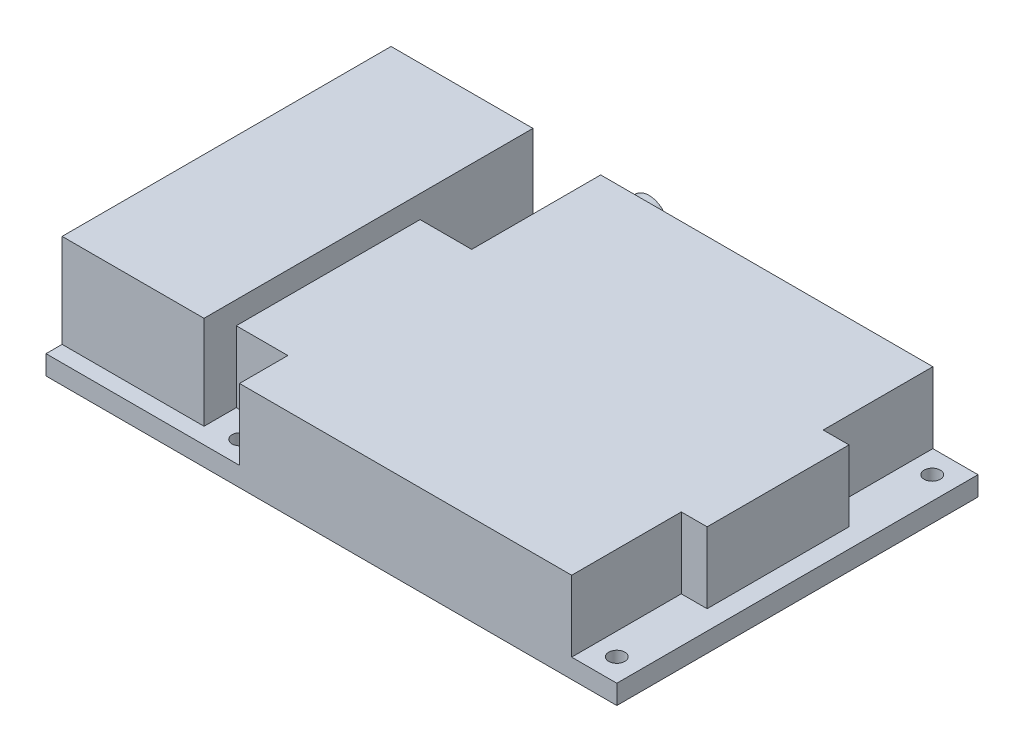
ISO-10303-21;
HEADER;
FILE_DESCRIPTION(('STEP AP214'),'2;1');
FILE_NAME('part.step','',(''),(''),'','','');
FILE_SCHEMA(('AUTOMOTIVE_DESIGN { 1 0 10303 214 1 1 1 1 }'));
ENDSEC;
DATA;
#1=APPLICATION_CONTEXT('core data for automotive mechanical design processes');
#2=APPLICATION_PROTOCOL_DEFINITION('international standard','automotive_design',2000,#1);
#3=PRODUCT_CONTEXT('',#1,'mechanical');
#4=PRODUCT('Part','Part','',(#3));
#5=PRODUCT_RELATED_PRODUCT_CATEGORY('part','',(#4));
#6=PRODUCT_DEFINITION_FORMATION('','',#4);
#7=PRODUCT_DEFINITION_CONTEXT('part definition',#1,'design');
#8=PRODUCT_DEFINITION('design','',#6,#7);
#9=PRODUCT_DEFINITION_SHAPE('','',#8);
#10=(LENGTH_UNIT() NAMED_UNIT(*) SI_UNIT(.MILLI.,.METRE.));
#11=(NAMED_UNIT(*) PLANE_ANGLE_UNIT() SI_UNIT($,.RADIAN.));
#12=(NAMED_UNIT(*) SI_UNIT($,.STERADIAN.) SOLID_ANGLE_UNIT());
#13=UNCERTAINTY_MEASURE_WITH_UNIT(LENGTH_MEASURE(1.E-05),#10,'distance_accuracy_value','');
#14=(GEOMETRIC_REPRESENTATION_CONTEXT(3) GLOBAL_UNCERTAINTY_ASSIGNED_CONTEXT((#13)) GLOBAL_UNIT_ASSIGNED_CONTEXT((#10,
#11,#12)) REPRESENTATION_CONTEXT('',''));
#15=CARTESIAN_POINT('',(0.,0.,0.));
#16=DIRECTION('',(0.,0.,1.));
#17=DIRECTION('',(1.,0.,0.));
#18=AXIS2_PLACEMENT_3D('',#15,#16,#17);
#19=CARTESIAN_POINT('',(0.,3.,0.));
#20=DIRECTION('',(0.,-1.,0.));
#21=DIRECTION('',(0.,0.,-1.));
#22=AXIS2_PLACEMENT_3D('',#19,#20,#21);
#23=PLANE('',#22);
#24=CARTESIAN_POINT('',(26.55,3.,-3.55));
#25=DIRECTION('',(0.,-1.,0.));
#26=DIRECTION('',(0.,0.,-1.));
#27=AXIS2_PLACEMENT_3D('',#24,#25,#26);
#28=CIRCLE('',#27,1.25);
#29=CARTESIAN_POINT('',(26.55,3.,-4.8));
#30=VERTEX_POINT('',#29);
#31=EDGE_CURVE('E422',#30,#30,#28,.F.);
#32=ORIENTED_EDGE('',*,*,#31,.F.);
#33=EDGE_LOOP('',(#32));
#34=FACE_BOUND('',#33,.T.);
#35=DIRECTION('',(1.,0.,0.));
#36=VECTOR('',#35,1.);
#37=CARTESIAN_POINT('',(0.,3.,-2.5));
#38=LINE('',#37,#36);
#39=CARTESIAN_POINT('',(0.,3.,-2.5));
#40=VERTEX_POINT('',#39);
#41=CARTESIAN_POINT('',(22.,3.,-2.5));
#42=VERTEX_POINT('',#41);
#43=EDGE_CURVE('E291',#40,#42,#38,.T.);
#44=ORIENTED_EDGE('',*,*,#43,.F.);
#45=DIRECTION('',(0.,0.,1.));
#46=VECTOR('',#45,1.);
#47=CARTESIAN_POINT('',(0.,3.,0.));
#48=LINE('',#47,#46);
#49=CARTESIAN_POINT('',(0.,3.,0.));
#50=VERTEX_POINT('',#49);
#51=EDGE_CURVE('E346',#40,#50,#48,.T.);
#52=ORIENTED_EDGE('',*,*,#51,.T.);
#53=DIRECTION('',(1.,0.,0.));
#54=VECTOR('',#53,1.);
#55=CARTESIAN_POINT('',(0.,3.,0.));
#56=LINE('',#55,#54);
#57=CARTESIAN_POINT('',(30.,3.,0.));
#58=VERTEX_POINT('',#57);
#59=EDGE_CURVE('E347',#50,#58,#56,.T.);
#60=ORIENTED_EDGE('',*,*,#59,.T.);
#61=DIRECTION('',(0.,0.,-1.));
#62=VECTOR('',#61,1.);
#63=CARTESIAN_POINT('',(30.,3.,0.));
#64=LINE('',#63,#62);
#65=CARTESIAN_POINT('',(30.,3.,-7.5));
#66=VERTEX_POINT('',#65);
#67=EDGE_CURVE('E250',#58,#66,#64,.T.);
#68=ORIENTED_EDGE('',*,*,#67,.T.);
#69=DIRECTION('',(-1.,0.,0.));
#70=VECTOR('',#69,1.);
#71=CARTESIAN_POINT('',(22.,3.,-7.5));
#72=LINE('',#71,#70);
#73=CARTESIAN_POINT('',(22.,3.,-7.5));
#74=VERTEX_POINT('',#73);
#75=EDGE_CURVE('E255',#66,#74,#72,.T.);
#76=ORIENTED_EDGE('',*,*,#75,.T.);
#77=DIRECTION('',(0.,0.,1.));
#78=VECTOR('',#77,1.);
#79=CARTESIAN_POINT('',(22.,3.,0.));
#80=LINE('',#79,#78);
#81=EDGE_CURVE('E205',#74,#42,#80,.T.);
#82=ORIENTED_EDGE('',*,*,#81,.T.);
#83=EDGE_LOOP('',(#44,#52,#60,#68,#76,#82));
#84=FACE_BOUND('',#83,.T.);
#85=ADVANCED_FACE('F45',(#34,#84),#23,.F.);
#86=CARTESIAN_POINT('',(26.55,3.,-52.45));
#87=DIRECTION('',(0.,-1.,0.));
#88=DIRECTION('',(0.,0.,-1.));
#89=AXIS2_PLACEMENT_3D('',#86,#87,#88);
#90=CIRCLE('',#89,1.25);
#91=CARTESIAN_POINT('',(26.55,3.,-53.7));
#92=VERTEX_POINT('',#91);
#93=EDGE_CURVE('E213',#92,#92,#90,.F.);
#94=ORIENTED_EDGE('',*,*,#93,.F.);
#95=EDGE_LOOP('',(#94));
#96=FACE_BOUND('',#95,.T.);
#97=DIRECTION('',(-1.,0.,0.));
#98=VECTOR('',#97,1.);
#99=CARTESIAN_POINT('',(0.,3.,-53.5));
#100=LINE('',#99,#98);
#101=CARTESIAN_POINT('',(22.,3.,-53.5));
#102=VERTEX_POINT('',#101);
#103=CARTESIAN_POINT('',(0.,3.,-53.5));
#104=VERTEX_POINT('',#103);
#105=EDGE_CURVE('E190',#102,#104,#100,.T.);
#106=ORIENTED_EDGE('',*,*,#105,.F.);
#107=DIRECTION('',(0.,0.,1.));
#108=VECTOR('',#107,1.);
#109=CARTESIAN_POINT('',(22.,3.,-56.));
#110=LINE('',#109,#108);
#111=CARTESIAN_POINT('',(22.,3.,-36.));
#112=VERTEX_POINT('',#111);
#113=EDGE_CURVE('E184',#102,#112,#110,.T.);
#114=ORIENTED_EDGE('',*,*,#113,.T.);
#115=DIRECTION('',(1.,0.,0.));
#116=VECTOR('',#115,1.);
#117=CARTESIAN_POINT('',(22.,3.,-36.));
#118=LINE('',#117,#116);
#119=CARTESIAN_POINT('',(30.,3.,-36.));
#120=VERTEX_POINT('',#119);
#121=EDGE_CURVE('E188',#112,#120,#118,.T.);
#122=ORIENTED_EDGE('',*,*,#121,.T.);
#123=DIRECTION('',(0.,0.,-1.));
#124=VECTOR('',#123,1.);
#125=CARTESIAN_POINT('',(30.,3.,-56.));
#126=LINE('',#125,#124);
#127=CARTESIAN_POINT('',(30.,3.,-56.));
#128=VERTEX_POINT('',#127);
#129=EDGE_CURVE('E223',#120,#128,#126,.T.);
#130=ORIENTED_EDGE('',*,*,#129,.T.);
#131=DIRECTION('',(-1.,0.,0.));
#132=VECTOR('',#131,1.);
#133=CARTESIAN_POINT('',(0.,3.,-56.));
#134=LINE('',#133,#132);
#135=CARTESIAN_POINT('',(0.,3.,-56.));
#136=VERTEX_POINT('',#135);
#137=EDGE_CURVE('E353',#128,#136,#134,.T.);
#138=ORIENTED_EDGE('',*,*,#137,.T.);
#139=EDGE_CURVE('E342',#136,#104,#48,.T.);
#140=ORIENTED_EDGE('',*,*,#139,.T.);
#141=EDGE_LOOP('',(#106,#114,#122,#130,#138,#140));
#142=FACE_BOUND('',#141,.T.);
#143=ADVANCED_FACE('F186',(#96,#142),#23,.F.);
#144=CARTESIAN_POINT('',(84.95,3.,-3.55));
#145=DIRECTION('',(0.,-1.,0.));
#146=DIRECTION('',(0.,0.,-1.));
#147=AXIS2_PLACEMENT_3D('',#144,#145,#146);
#148=CIRCLE('',#147,1.25);
#149=CARTESIAN_POINT('',(84.95,3.,-4.8));
#150=VERTEX_POINT('',#149);
#151=EDGE_CURVE('E418',#150,#150,#148,.F.);
#152=ORIENTED_EDGE('',*,*,#151,.F.);
#153=EDGE_LOOP('',(#152));
#154=FACE_BOUND('',#153,.T.);
#155=CARTESIAN_POINT('',(84.95,3.,-52.45));
#156=DIRECTION('',(0.,-1.,0.));
#157=DIRECTION('',(0.,0.,-1.));
#158=AXIS2_PLACEMENT_3D('',#155,#156,#157);
#159=CIRCLE('',#158,1.25);
#160=CARTESIAN_POINT('',(84.95,3.,-53.7));
#161=VERTEX_POINT('',#160);
#162=EDGE_CURVE('E412',#161,#161,#159,.F.);
#163=ORIENTED_EDGE('',*,*,#162,.F.);
#164=EDGE_LOOP('',(#163));
#165=FACE_BOUND('',#164,.T.);
#166=DIRECTION('',(0.,0.,-1.));
#167=VECTOR('',#166,1.);
#168=CARTESIAN_POINT('',(85.5,3.,-56.));
#169=LINE('',#168,#167);
#170=CARTESIAN_POINT('',(85.5,3.,-17.));
#171=VERTEX_POINT('',#170);
#172=CARTESIAN_POINT('',(85.5,3.,-39.));
#173=VERTEX_POINT('',#172);
#174=EDGE_CURVE('E323',#171,#173,#169,.T.);
#175=ORIENTED_EDGE('',*,*,#174,.F.);
#176=DIRECTION('',(-1.,0.,0.));
#177=VECTOR('',#176,1.);
#178=CARTESIAN_POINT('',(85.5,3.,-17.));
#179=LINE('',#178,#177);
#180=CARTESIAN_POINT('',(81.5,3.,-17.));
#181=VERTEX_POINT('',#180);
#182=EDGE_CURVE('E232',#171,#181,#179,.T.);
#183=ORIENTED_EDGE('',*,*,#182,.T.);
#184=DIRECTION('',(0.,0.,1.));
#185=VECTOR('',#184,1.);
#186=CARTESIAN_POINT('',(81.5,3.,0.));
#187=LINE('',#186,#185);
#188=CARTESIAN_POINT('',(81.5,3.,0.));
#189=VERTEX_POINT('',#188);
#190=EDGE_CURVE('E271',#181,#189,#187,.T.);
#191=ORIENTED_EDGE('',*,*,#190,.T.);
#192=CARTESIAN_POINT('',(88.5,3.,0.));
#193=VERTEX_POINT('',#192);
#194=EDGE_CURVE('E345',#189,#193,#56,.T.);
#195=ORIENTED_EDGE('',*,*,#194,.T.);
#196=DIRECTION('',(0.,0.,-1.));
#197=VECTOR('',#196,1.);
#198=CARTESIAN_POINT('',(88.5,3.,0.));
#199=LINE('',#198,#197);
#200=CARTESIAN_POINT('',(88.5,3.,-56.));
#201=VERTEX_POINT('',#200);
#202=EDGE_CURVE('E350',#193,#201,#199,.T.);
#203=ORIENTED_EDGE('',*,*,#202,.T.);
#204=CARTESIAN_POINT('',(81.5,3.,-56.));
#205=VERTEX_POINT('',#204);
#206=EDGE_CURVE('E354',#201,#205,#134,.T.);
#207=ORIENTED_EDGE('',*,*,#206,.T.);
#208=DIRECTION('',(0.,0.,1.));
#209=VECTOR('',#208,1.);
#210=CARTESIAN_POINT('',(81.5,3.,-56.));
#211=LINE('',#210,#209);
#212=CARTESIAN_POINT('',(81.5,3.,-39.));
#213=VERTEX_POINT('',#212);
#214=EDGE_CURVE('E233',#205,#213,#211,.T.);
#215=ORIENTED_EDGE('',*,*,#214,.T.);
#216=DIRECTION('',(1.,0.,0.));
#217=VECTOR('',#216,1.);
#218=CARTESIAN_POINT('',(85.5,3.,-39.));
#219=LINE('',#218,#217);
#220=EDGE_CURVE('E236',#213,#173,#219,.T.);
#221=ORIENTED_EDGE('',*,*,#220,.T.);
#222=EDGE_LOOP('',(#175,#183,#191,#195,#203,#207,#215,#221));
#223=FACE_BOUND('',#222,.T.);
#224=ADVANCED_FACE('F472',(#154,#165,#223),#23,.F.);
#225=CARTESIAN_POINT('',(0.,3.,0.));
#226=DIRECTION('',(1.,0.,0.));
#227=DIRECTION('',(0.,0.,-1.));
#228=AXIS2_PLACEMENT_3D('',#225,#226,#227);
#229=PLANE('',#228);
#230=DIRECTION('',(0.,0.,1.));
#231=VECTOR('',#230,1.);
#232=CARTESIAN_POINT('',(0.,0.,0.));
#233=LINE('',#232,#231);
#234=CARTESIAN_POINT('',(0.,0.,-56.));
#235=VERTEX_POINT('',#234);
#236=CARTESIAN_POINT('',(0.,0.,0.));
#237=VERTEX_POINT('',#236);
#238=EDGE_CURVE('E338',#235,#237,#233,.T.);
#239=ORIENTED_EDGE('',*,*,#238,.T.);
#240=DIRECTION('',(0.,-1.,0.));
#241=VECTOR('',#240,1.);
#242=CARTESIAN_POINT('',(0.,3.,0.));
#243=LINE('',#242,#241);
#244=EDGE_CURVE('E381',#50,#237,#243,.T.);
#245=ORIENTED_EDGE('',*,*,#244,.F.);
#246=ORIENTED_EDGE('',*,*,#51,.F.);
#247=DIRECTION('',(0.,-1.,0.));
#248=VECTOR('',#247,1.);
#249=CARTESIAN_POINT('',(0.,17.5,-2.5));
#250=LINE('',#249,#248);
#251=CARTESIAN_POINT('',(0.,17.5,-2.5));
#252=VERTEX_POINT('',#251);
#253=EDGE_CURVE('E320',#252,#40,#250,.T.);
#254=ORIENTED_EDGE('',*,*,#253,.F.);
#255=DIRECTION('',(0.,0.,1.));
#256=VECTOR('',#255,1.);
#257=CARTESIAN_POINT('',(0.,17.5,-2.5));
#258=LINE('',#257,#256);
#259=CARTESIAN_POINT('',(0.,17.5,-53.5));
#260=VERTEX_POINT('',#259);
#261=EDGE_CURVE('E292',#260,#252,#258,.T.);
#262=ORIENTED_EDGE('',*,*,#261,.F.);
#263=DIRECTION('',(0.,-1.,0.));
#264=VECTOR('',#263,1.);
#265=CARTESIAN_POINT('',(0.,17.5,-53.5));
#266=LINE('',#265,#264);
#267=EDGE_CURVE('E305',#260,#104,#266,.T.);
#268=ORIENTED_EDGE('',*,*,#267,.T.);
#269=ORIENTED_EDGE('',*,*,#139,.F.);
#270=DIRECTION('',(0.,-1.,0.));
#271=VECTOR('',#270,1.);
#272=CARTESIAN_POINT('',(0.,3.,-56.));
#273=LINE('',#272,#271);
#274=EDGE_CURVE('E357',#136,#235,#273,.T.);
#275=ORIENTED_EDGE('',*,*,#274,.T.);
#276=EDGE_LOOP('',(#239,#245,#246,#254,#262,#268,#269,#275));
#277=FACE_BOUND('',#276,.T.);
#278=ADVANCED_FACE('F47',(#277),#229,.F.);
#279=CARTESIAN_POINT('',(0.,3.,0.));
#280=DIRECTION('',(0.,0.,-1.));
#281=DIRECTION('',(-1.,0.,0.));
#282=AXIS2_PLACEMENT_3D('',#279,#280,#281);
#283=PLANE('',#282);
#284=DIRECTION('',(0.,1.,0.));
#285=VECTOR('',#284,1.);
#286=CARTESIAN_POINT('',(30.,-18.540659228538,0.));
#287=LINE('',#286,#285);
#288=CARTESIAN_POINT('',(30.,14.,0.));
#289=VERTEX_POINT('',#288);
#290=EDGE_CURVE('E241',#58,#289,#287,.T.);
#291=ORIENTED_EDGE('',*,*,#290,.F.);
#292=ORIENTED_EDGE('',*,*,#59,.F.);
#293=ORIENTED_EDGE('',*,*,#244,.T.);
#294=DIRECTION('',(1.,0.,0.));
#295=VECTOR('',#294,1.);
#296=CARTESIAN_POINT('',(0.,0.,0.));
#297=LINE('',#296,#295);
#298=CARTESIAN_POINT('',(88.5,0.,0.));
#299=VERTEX_POINT('',#298);
#300=EDGE_CURVE('E361',#237,#299,#297,.T.);
#301=ORIENTED_EDGE('',*,*,#300,.T.);
#302=DIRECTION('',(0.,-1.,0.));
#303=VECTOR('',#302,1.);
#304=CARTESIAN_POINT('',(88.5,3.,0.));
#305=LINE('',#304,#303);
#306=EDGE_CURVE('E377',#193,#299,#305,.T.);
#307=ORIENTED_EDGE('',*,*,#306,.F.);
#308=ORIENTED_EDGE('',*,*,#194,.F.);
#309=DIRECTION('',(0.,1.,0.));
#310=VECTOR('',#309,1.);
#311=CARTESIAN_POINT('',(81.5,-18.540659228538,0.));
#312=LINE('',#311,#310);
#313=CARTESIAN_POINT('',(81.5,14.,0.));
#314=VERTEX_POINT('',#313);
#315=EDGE_CURVE('E275',#189,#314,#312,.T.);
#316=ORIENTED_EDGE('',*,*,#315,.T.);
#317=DIRECTION('',(1.,0.,0.));
#318=VECTOR('',#317,1.);
#319=CARTESIAN_POINT('',(85.5,14.,0.));
#320=LINE('',#319,#318);
#321=EDGE_CURVE('E334',#289,#314,#320,.T.);
#322=ORIENTED_EDGE('',*,*,#321,.F.);
#323=EDGE_LOOP('',(#291,#292,#293,#301,#307,#308,#316,#322));
#324=FACE_BOUND('',#323,.T.);
#325=ADVANCED_FACE('F509',(#324),#283,.F.);
#326=CARTESIAN_POINT('',(88.5,3.,0.));
#327=DIRECTION('',(-1.,0.,0.));
#328=DIRECTION('',(0.,0.,1.));
#329=AXIS2_PLACEMENT_3D('',#326,#327,#328);
#330=PLANE('',#329);
#331=DIRECTION('',(0.,0.,-1.));
#332=VECTOR('',#331,1.);
#333=CARTESIAN_POINT('',(88.5,0.,0.));
#334=LINE('',#333,#332);
#335=CARTESIAN_POINT('',(88.5,0.,-56.));
#336=VERTEX_POINT('',#335);
#337=EDGE_CURVE('E364',#299,#336,#334,.T.);
#338=ORIENTED_EDGE('',*,*,#337,.T.);
#339=DIRECTION('',(0.,-1.,0.));
#340=VECTOR('',#339,1.);
#341=CARTESIAN_POINT('',(88.5,3.,-56.));
#342=LINE('',#341,#340);
#343=EDGE_CURVE('E373',#201,#336,#342,.T.);
#344=ORIENTED_EDGE('',*,*,#343,.F.);
#345=ORIENTED_EDGE('',*,*,#202,.F.);
#346=ORIENTED_EDGE('',*,*,#306,.T.);
#347=EDGE_LOOP('',(#338,#344,#345,#346));
#348=FACE_BOUND('',#347,.T.);
#349=ADVANCED_FACE('F455',(#348),#330,.F.);
#350=CARTESIAN_POINT('',(0.,3.,-56.));
#351=DIRECTION('',(0.,0.,1.));
#352=DIRECTION('',(1.,0.,0.));
#353=AXIS2_PLACEMENT_3D('',#350,#351,#352);
#354=PLANE('',#353);
#355=CARTESIAN_POINT('',(35.,9.5,-56.));
#356=DIRECTION('',(0.,0.,1.));
#357=DIRECTION('',(1.,0.,0.));
#358=AXIS2_PLACEMENT_3D('',#355,#356,#357);
#359=CIRCLE('',#358,3.);
#360=CARTESIAN_POINT('',(38.,9.5,-56.));
#361=VERTEX_POINT('',#360);
#362=EDGE_CURVE('E11',#361,#361,#359,.F.);
#363=ORIENTED_EDGE('',*,*,#362,.F.);
#364=EDGE_LOOP('',(#363));
#365=FACE_BOUND('',#364,.T.);
#366=DIRECTION('',(0.,1.,0.));
#367=VECTOR('',#366,1.);
#368=CARTESIAN_POINT('',(81.5,-18.540659228538,-56.));
#369=LINE('',#368,#367);
#370=CARTESIAN_POINT('',(81.5,14.,-56.));
#371=VERTEX_POINT('',#370);
#372=EDGE_CURVE('E229',#205,#371,#369,.T.);
#373=ORIENTED_EDGE('',*,*,#372,.F.);
#374=ORIENTED_EDGE('',*,*,#206,.F.);
#375=ORIENTED_EDGE('',*,*,#343,.T.);
#376=DIRECTION('',(-1.,0.,0.));
#377=VECTOR('',#376,1.);
#378=CARTESIAN_POINT('',(0.,0.,-56.));
#379=LINE('',#378,#377);
#380=EDGE_CURVE('E367',#336,#235,#379,.T.);
#381=ORIENTED_EDGE('',*,*,#380,.T.);
#382=ORIENTED_EDGE('',*,*,#274,.F.);
#383=ORIENTED_EDGE('',*,*,#137,.F.);
#384=DIRECTION('',(0.,1.,0.));
#385=VECTOR('',#384,1.);
#386=CARTESIAN_POINT('',(30.,-18.540659228538,-56.));
#387=LINE('',#386,#385);
#388=CARTESIAN_POINT('',(30.,14.,-56.));
#389=VERTEX_POINT('',#388);
#390=EDGE_CURVE('E195',#128,#389,#387,.T.);
#391=ORIENTED_EDGE('',*,*,#390,.T.);
#392=DIRECTION('',(-1.,0.,0.));
#393=VECTOR('',#392,1.);
#394=CARTESIAN_POINT('',(85.5,14.,-56.));
#395=LINE('',#394,#393);
#396=EDGE_CURVE('E328',#371,#389,#395,.T.);
#397=ORIENTED_EDGE('',*,*,#396,.F.);
#398=EDGE_LOOP('',(#373,#374,#375,#381,#382,#383,#391,#397));
#399=FACE_BOUND('',#398,.T.);
#400=ADVANCED_FACE('F451',(#365,#399),#354,.F.);
#401=CARTESIAN_POINT('',(0.,0.,0.));
#402=DIRECTION('',(0.,-1.,0.));
#403=DIRECTION('',(0.,0.,-1.));
#404=AXIS2_PLACEMENT_3D('',#401,#402,#403);
#405=PLANE('',#404);
#406=CARTESIAN_POINT('',(26.55,0.,-52.45));
#407=DIRECTION('',(0.,-1.,0.));
#408=DIRECTION('',(0.,0.,-1.));
#409=AXIS2_PLACEMENT_3D('',#406,#407,#408);
#410=CIRCLE('',#409,1.25);
#411=CARTESIAN_POINT('',(26.55,0.,-53.7));
#412=VERTEX_POINT('',#411);
#413=EDGE_CURVE('E217',#412,#412,#410,.F.);
#414=ORIENTED_EDGE('',*,*,#413,.T.);
#415=EDGE_LOOP('',(#414));
#416=FACE_BOUND('',#415,.T.);
#417=CARTESIAN_POINT('',(26.55,0.,-3.55));
#418=DIRECTION('',(0.,-1.,0.));
#419=DIRECTION('',(0.,0.,-1.));
#420=AXIS2_PLACEMENT_3D('',#417,#418,#419);
#421=CIRCLE('',#420,1.25);
#422=CARTESIAN_POINT('',(26.55,0.,-4.8));
#423=VERTEX_POINT('',#422);
#424=EDGE_CURVE('E419',#423,#423,#421,.F.);
#425=ORIENTED_EDGE('',*,*,#424,.T.);
#426=EDGE_LOOP('',(#425));
#427=FACE_BOUND('',#426,.T.);
#428=CARTESIAN_POINT('',(84.95,0.,-3.55));
#429=DIRECTION('',(0.,-1.,0.));
#430=DIRECTION('',(0.,0.,-1.));
#431=AXIS2_PLACEMENT_3D('',#428,#429,#430);
#432=CIRCLE('',#431,1.25);
#433=CARTESIAN_POINT('',(84.95,0.,-4.8));
#434=VERTEX_POINT('',#433);
#435=EDGE_CURVE('E414',#434,#434,#432,.F.);
#436=ORIENTED_EDGE('',*,*,#435,.T.);
#437=EDGE_LOOP('',(#436));
#438=FACE_BOUND('',#437,.T.);
#439=CARTESIAN_POINT('',(84.95,0.,-52.45));
#440=DIRECTION('',(0.,-1.,0.));
#441=DIRECTION('',(0.,0.,-1.));
#442=AXIS2_PLACEMENT_3D('',#439,#440,#441);
#443=CIRCLE('',#442,1.25);
#444=CARTESIAN_POINT('',(84.95,0.,-53.7));
#445=VERTEX_POINT('',#444);
#446=EDGE_CURVE('E408',#445,#445,#443,.F.);
#447=ORIENTED_EDGE('',*,*,#446,.T.);
#448=EDGE_LOOP('',(#447));
#449=FACE_BOUND('',#448,.T.);
#450=ORIENTED_EDGE('',*,*,#238,.F.);
#451=ORIENTED_EDGE('',*,*,#380,.F.);
#452=ORIENTED_EDGE('',*,*,#337,.F.);
#453=ORIENTED_EDGE('',*,*,#300,.F.);
#454=EDGE_LOOP('',(#450,#451,#452,#453));
#455=FACE_BOUND('',#454,.T.);
#456=ADVANCED_FACE('F454',(#416,#427,#438,#449,#455),#405,.T.);
#457=CARTESIAN_POINT('',(85.5,14.,-56.));
#458=DIRECTION('',(-1.,0.,0.));
#459=DIRECTION('',(0.,0.,1.));
#460=AXIS2_PLACEMENT_3D('',#457,#458,#459);
#461=PLANE('',#460);
#462=ORIENTED_EDGE('',*,*,#174,.T.);
#463=DIRECTION('',(0.,1.,0.));
#464=VECTOR('',#463,1.);
#465=CARTESIAN_POINT('',(85.5,-18.540659228538,-39.));
#466=LINE('',#465,#464);
#467=CARTESIAN_POINT('',(85.5,14.,-39.));
#468=VERTEX_POINT('',#467);
#469=EDGE_CURVE('E237',#173,#468,#466,.T.);
#470=ORIENTED_EDGE('',*,*,#469,.T.);
#471=DIRECTION('',(0.,0.,-1.));
#472=VECTOR('',#471,1.);
#473=CARTESIAN_POINT('',(85.5,14.,-56.));
#474=LINE('',#473,#472);
#475=CARTESIAN_POINT('',(85.5,14.,-17.));
#476=VERTEX_POINT('',#475);
#477=EDGE_CURVE('E324',#476,#468,#474,.T.);
#478=ORIENTED_EDGE('',*,*,#477,.F.);
#479=DIRECTION('',(0.,1.,0.));
#480=VECTOR('',#479,1.);
#481=CARTESIAN_POINT('',(85.5,-18.540659228538,-17.));
#482=LINE('',#481,#480);
#483=EDGE_CURVE('E279',#171,#476,#482,.T.);
#484=ORIENTED_EDGE('',*,*,#483,.F.);
#485=EDGE_LOOP('',(#462,#470,#478,#484));
#486=FACE_BOUND('',#485,.T.);
#487=ADVANCED_FACE('F468',(#486),#461,.F.);
#488=CARTESIAN_POINT('',(0.,14.,0.));
#489=DIRECTION('',(0.,-1.,0.));
#490=DIRECTION('',(0.,0.,-1.));
#491=AXIS2_PLACEMENT_3D('',#488,#489,#490);
#492=PLANE('',#491);
#493=DIRECTION('',(-1.,0.,0.));
#494=VECTOR('',#493,1.);
#495=CARTESIAN_POINT('',(0.,14.,-39.));
#496=LINE('',#495,#494);
#497=CARTESIAN_POINT('',(81.5,14.,-39.));
#498=VERTEX_POINT('',#497);
#499=EDGE_CURVE('E401',#468,#498,#496,.T.);
#500=ORIENTED_EDGE('',*,*,#499,.T.);
#501=DIRECTION('',(0.,0.,-1.));
#502=VECTOR('',#501,1.);
#503=CARTESIAN_POINT('',(81.5,14.,0.));
#504=LINE('',#503,#502);
#505=EDGE_CURVE('E54',#498,#371,#504,.T.);
#506=ORIENTED_EDGE('',*,*,#505,.T.);
#507=ORIENTED_EDGE('',*,*,#396,.T.);
#508=DIRECTION('',(0.,0.,1.));
#509=VECTOR('',#508,1.);
#510=CARTESIAN_POINT('',(30.,14.,0.));
#511=LINE('',#510,#509);
#512=CARTESIAN_POINT('',(30.,14.,-36.));
#513=VERTEX_POINT('',#512);
#514=EDGE_CURVE('E393',#389,#513,#511,.T.);
#515=ORIENTED_EDGE('',*,*,#514,.T.);
#516=DIRECTION('',(-1.,0.,0.));
#517=VECTOR('',#516,1.);
#518=CARTESIAN_POINT('',(0.,14.,-36.));
#519=LINE('',#518,#517);
#520=CARTESIAN_POINT('',(22.,14.,-36.));
#521=VERTEX_POINT('',#520);
#522=EDGE_CURVE('E284',#513,#521,#519,.T.);
#523=ORIENTED_EDGE('',*,*,#522,.T.);
#524=DIRECTION('',(0.,0.,1.));
#525=VECTOR('',#524,1.);
#526=CARTESIAN_POINT('',(22.,14.,-56.));
#527=LINE('',#526,#525);
#528=CARTESIAN_POINT('',(22.,14.,-7.5));
#529=VERTEX_POINT('',#528);
#530=EDGE_CURVE('E211',#521,#529,#527,.T.);
#531=ORIENTED_EDGE('',*,*,#530,.T.);
#532=DIRECTION('',(1.,0.,0.));
#533=VECTOR('',#532,1.);
#534=CARTESIAN_POINT('',(0.,14.,-7.5));
#535=LINE('',#534,#533);
#536=CARTESIAN_POINT('',(30.,14.,-7.5));
#537=VERTEX_POINT('',#536);
#538=EDGE_CURVE('E287',#529,#537,#535,.T.);
#539=ORIENTED_EDGE('',*,*,#538,.T.);
#540=DIRECTION('',(0.,0.,1.));
#541=VECTOR('',#540,1.);
#542=CARTESIAN_POINT('',(30.,14.,0.));
#543=LINE('',#542,#541);
#544=EDGE_CURVE('E397',#537,#289,#543,.T.);
#545=ORIENTED_EDGE('',*,*,#544,.T.);
#546=ORIENTED_EDGE('',*,*,#321,.T.);
#547=DIRECTION('',(0.,0.,-1.));
#548=VECTOR('',#547,1.);
#549=CARTESIAN_POINT('',(81.5,14.,0.));
#550=LINE('',#549,#548);
#551=CARTESIAN_POINT('',(81.5,14.,-17.));
#552=VERTEX_POINT('',#551);
#553=EDGE_CURVE('E385',#314,#552,#550,.T.);
#554=ORIENTED_EDGE('',*,*,#553,.T.);
#555=DIRECTION('',(1.,0.,0.));
#556=VECTOR('',#555,1.);
#557=CARTESIAN_POINT('',(0.,14.,-17.));
#558=LINE('',#557,#556);
#559=EDGE_CURVE('E389',#552,#476,#558,.T.);
#560=ORIENTED_EDGE('',*,*,#559,.T.);
#561=ORIENTED_EDGE('',*,*,#477,.T.);
#562=EDGE_LOOP('',(#500,#506,#507,#515,#523,#531,#539,#545,#546,#554,#560,#561));
#563=FACE_BOUND('',#562,.T.);
#564=ADVANCED_FACE('F464',(#563),#492,.F.);
#565=CARTESIAN_POINT('',(22.,17.5,-2.5));
#566=DIRECTION('',(-1.,0.,0.));
#567=DIRECTION('',(0.,0.,1.));
#568=AXIS2_PLACEMENT_3D('',#565,#566,#567);
#569=PLANE('',#568);
#570=DIRECTION('',(0.,-1.,0.));
#571=VECTOR('',#570,1.);
#572=CARTESIAN_POINT('',(22.,17.5,-53.5));
#573=LINE('',#572,#571);
#574=CARTESIAN_POINT('',(22.,17.5,-53.5));
#575=VERTEX_POINT('',#574);
#576=EDGE_CURVE('E314',#575,#102,#573,.T.);
#577=ORIENTED_EDGE('',*,*,#576,.F.);
#578=DIRECTION('',(0.,0.,-1.));
#579=VECTOR('',#578,1.);
#580=CARTESIAN_POINT('',(22.,17.5,-2.5));
#581=LINE('',#580,#579);
#582=CARTESIAN_POINT('',(22.,17.5,-2.5));
#583=VERTEX_POINT('',#582);
#584=EDGE_CURVE('E299',#583,#575,#581,.T.);
#585=ORIENTED_EDGE('',*,*,#584,.F.);
#586=DIRECTION('',(0.,-1.,0.));
#587=VECTOR('',#586,1.);
#588=CARTESIAN_POINT('',(22.,17.5,-2.5));
#589=LINE('',#588,#587);
#590=EDGE_CURVE('E317',#583,#42,#589,.T.);
#591=ORIENTED_EDGE('',*,*,#590,.T.);
#592=ORIENTED_EDGE('',*,*,#81,.F.);
#593=DIRECTION('',(0.,1.,0.));
#594=VECTOR('',#593,1.);
#595=CARTESIAN_POINT('',(22.,-18.540659228538,-7.5));
#596=LINE('',#595,#594);
#597=EDGE_CURVE('E256',#74,#529,#596,.T.);
#598=ORIENTED_EDGE('',*,*,#597,.T.);
#599=ORIENTED_EDGE('',*,*,#530,.F.);
#600=DIRECTION('',(0.,1.,0.));
#601=VECTOR('',#600,1.);
#602=CARTESIAN_POINT('',(22.,-18.540659228538,-36.));
#603=LINE('',#602,#601);
#604=EDGE_CURVE('E196',#112,#521,#603,.T.);
#605=ORIENTED_EDGE('',*,*,#604,.F.);
#606=ORIENTED_EDGE('',*,*,#113,.F.);
#607=EDGE_LOOP('',(#577,#585,#591,#592,#598,#599,#605,#606));
#608=FACE_BOUND('',#607,.T.);
#609=ADVANCED_FACE('F208',(#608),#569,.F.);
#610=CARTESIAN_POINT('',(0.,17.5,-2.5));
#611=DIRECTION('',(0.,0.,-1.));
#612=DIRECTION('',(-1.,0.,0.));
#613=AXIS2_PLACEMENT_3D('',#610,#611,#612);
#614=PLANE('',#613);
#615=ORIENTED_EDGE('',*,*,#43,.T.);
#616=ORIENTED_EDGE('',*,*,#590,.F.);
#617=DIRECTION('',(1.,0.,0.));
#618=VECTOR('',#617,1.);
#619=CARTESIAN_POINT('',(0.,17.5,-2.5));
#620=LINE('',#619,#618);
#621=EDGE_CURVE('E296',#252,#583,#620,.T.);
#622=ORIENTED_EDGE('',*,*,#621,.F.);
#623=ORIENTED_EDGE('',*,*,#253,.T.);
#624=EDGE_LOOP('',(#615,#616,#622,#623));
#625=FACE_BOUND('',#624,.T.);
#626=ADVANCED_FACE('F500',(#625),#614,.F.);
#627=CARTESIAN_POINT('',(0.,17.5,-53.5));
#628=DIRECTION('',(0.,0.,1.));
#629=DIRECTION('',(1.,0.,0.));
#630=AXIS2_PLACEMENT_3D('',#627,#628,#629);
#631=PLANE('',#630);
#632=ORIENTED_EDGE('',*,*,#105,.T.);
#633=ORIENTED_EDGE('',*,*,#267,.F.);
#634=DIRECTION('',(-1.,0.,0.));
#635=VECTOR('',#634,1.);
#636=CARTESIAN_POINT('',(0.,17.5,-53.5));
#637=LINE('',#636,#635);
#638=EDGE_CURVE('E302',#575,#260,#637,.T.);
#639=ORIENTED_EDGE('',*,*,#638,.F.);
#640=ORIENTED_EDGE('',*,*,#576,.T.);
#641=EDGE_LOOP('',(#632,#633,#639,#640));
#642=FACE_BOUND('',#641,.T.);
#643=ADVANCED_FACE('F575',(#642),#631,.F.);
#644=CARTESIAN_POINT('',(0.,17.5,0.));
#645=DIRECTION('',(0.,-1.,0.));
#646=DIRECTION('',(0.,0.,-1.));
#647=AXIS2_PLACEMENT_3D('',#644,#645,#646);
#648=PLANE('',#647);
#649=ORIENTED_EDGE('',*,*,#261,.T.);
#650=ORIENTED_EDGE('',*,*,#621,.T.);
#651=ORIENTED_EDGE('',*,*,#584,.T.);
#652=ORIENTED_EDGE('',*,*,#638,.T.);
#653=EDGE_LOOP('',(#649,#650,#651,#652));
#654=FACE_BOUND('',#653,.T.);
#655=ADVANCED_FACE('F559',(#654),#648,.F.);
#656=CARTESIAN_POINT('',(30.,-18.540659228538,-56.));
#657=DIRECTION('',(1.,0.,0.));
#658=DIRECTION('',(0.,0.,-1.));
#659=AXIS2_PLACEMENT_3D('',#656,#657,#658);
#660=PLANE('',#659);
#661=ORIENTED_EDGE('',*,*,#390,.F.);
#662=ORIENTED_EDGE('',*,*,#129,.F.);
#663=DIRECTION('',(0.,1.,0.));
#664=VECTOR('',#663,1.);
#665=CARTESIAN_POINT('',(30.,-18.540659228538,-36.));
#666=LINE('',#665,#664);
#667=EDGE_CURVE('E203',#120,#513,#666,.T.);
#668=ORIENTED_EDGE('',*,*,#667,.T.);
#669=ORIENTED_EDGE('',*,*,#514,.F.);
#670=EDGE_LOOP('',(#661,#662,#668,#669));
#671=FACE_BOUND('',#670,.T.);
#672=ADVANCED_FACE('F489',(#671),#660,.F.);
#673=CARTESIAN_POINT('',(22.,-18.540659228538,-36.));
#674=DIRECTION('',(0.,0.,1.));
#675=DIRECTION('',(1.,0.,0.));
#676=AXIS2_PLACEMENT_3D('',#673,#674,#675);
#677=PLANE('',#676);
#678=ORIENTED_EDGE('',*,*,#667,.F.);
#679=ORIENTED_EDGE('',*,*,#121,.F.);
#680=ORIENTED_EDGE('',*,*,#604,.T.);
#681=ORIENTED_EDGE('',*,*,#522,.F.);
#682=EDGE_LOOP('',(#678,#679,#680,#681));
#683=FACE_BOUND('',#682,.T.);
#684=ADVANCED_FACE('F200',(#683),#677,.F.);
#685=CARTESIAN_POINT('',(30.,-18.540659228538,0.));
#686=DIRECTION('',(1.,0.,0.));
#687=DIRECTION('',(0.,0.,-1.));
#688=AXIS2_PLACEMENT_3D('',#685,#686,#687);
#689=PLANE('',#688);
#690=DIRECTION('',(0.,1.,0.));
#691=VECTOR('',#690,1.);
#692=CARTESIAN_POINT('',(30.,-18.540659228538,-7.5));
#693=LINE('',#692,#691);
#694=EDGE_CURVE('E251',#66,#537,#693,.T.);
#695=ORIENTED_EDGE('',*,*,#694,.F.);
#696=ORIENTED_EDGE('',*,*,#67,.F.);
#697=ORIENTED_EDGE('',*,*,#290,.T.);
#698=ORIENTED_EDGE('',*,*,#544,.F.);
#699=EDGE_LOOP('',(#695,#696,#697,#698));
#700=FACE_BOUND('',#699,.T.);
#701=ADVANCED_FACE('F511',(#700),#689,.F.);
#702=CARTESIAN_POINT('',(22.,-18.540659228538,-7.5));
#703=DIRECTION('',(0.,0.,-1.));
#704=DIRECTION('',(-1.,0.,0.));
#705=AXIS2_PLACEMENT_3D('',#702,#703,#704);
#706=PLANE('',#705);
#707=ORIENTED_EDGE('',*,*,#597,.F.);
#708=ORIENTED_EDGE('',*,*,#75,.F.);
#709=ORIENTED_EDGE('',*,*,#694,.T.);
#710=ORIENTED_EDGE('',*,*,#538,.F.);
#711=EDGE_LOOP('',(#707,#708,#709,#710));
#712=FACE_BOUND('',#711,.T.);
#713=ADVANCED_FACE('F493',(#712),#706,.F.);
#714=CARTESIAN_POINT('',(85.5,-18.540659228538,-17.));
#715=DIRECTION('',(0.,0.,-1.));
#716=DIRECTION('',(-1.,0.,0.));
#717=AXIS2_PLACEMENT_3D('',#714,#715,#716);
#718=PLANE('',#717);
#719=DIRECTION('',(0.,1.,0.));
#720=VECTOR('',#719,1.);
#721=CARTESIAN_POINT('',(81.5,-18.540659228538,-17.));
#722=LINE('',#721,#720);
#723=EDGE_CURVE('E69',#181,#552,#722,.T.);
#724=ORIENTED_EDGE('',*,*,#723,.F.);
#725=ORIENTED_EDGE('',*,*,#182,.F.);
#726=ORIENTED_EDGE('',*,*,#483,.T.);
#727=ORIENTED_EDGE('',*,*,#559,.F.);
#728=EDGE_LOOP('',(#724,#725,#726,#727));
#729=FACE_BOUND('',#728,.T.);
#730=ADVANCED_FACE('F518',(#729),#718,.F.);
#731=CARTESIAN_POINT('',(81.5,-18.540659228538,0.));
#732=DIRECTION('',(-1.,0.,0.));
#733=DIRECTION('',(0.,0.,1.));
#734=AXIS2_PLACEMENT_3D('',#731,#732,#733);
#735=PLANE('',#734);
#736=ORIENTED_EDGE('',*,*,#315,.F.);
#737=ORIENTED_EDGE('',*,*,#190,.F.);
#738=ORIENTED_EDGE('',*,*,#723,.T.);
#739=ORIENTED_EDGE('',*,*,#553,.F.);
#740=EDGE_LOOP('',(#736,#737,#738,#739));
#741=FACE_BOUND('',#740,.T.);
#742=ADVANCED_FACE('F561',(#741),#735,.F.);
#743=CARTESIAN_POINT('',(81.5,-18.540659228538,-56.));
#744=DIRECTION('',(-1.,0.,0.));
#745=DIRECTION('',(0.,0.,1.));
#746=AXIS2_PLACEMENT_3D('',#743,#744,#745);
#747=PLANE('',#746);
#748=DIRECTION('',(0.,1.,0.));
#749=VECTOR('',#748,1.);
#750=CARTESIAN_POINT('',(81.5,-18.540659228538,-39.));
#751=LINE('',#750,#749);
#752=EDGE_CURVE('E61',#213,#498,#751,.T.);
#753=ORIENTED_EDGE('',*,*,#752,.F.);
#754=ORIENTED_EDGE('',*,*,#214,.F.);
#755=ORIENTED_EDGE('',*,*,#372,.T.);
#756=ORIENTED_EDGE('',*,*,#505,.F.);
#757=EDGE_LOOP('',(#753,#754,#755,#756));
#758=FACE_BOUND('',#757,.T.);
#759=ADVANCED_FACE('F462',(#758),#747,.F.);
#760=CARTESIAN_POINT('',(85.5,-18.540659228538,-39.));
#761=DIRECTION('',(0.,0.,1.));
#762=DIRECTION('',(1.,0.,0.));
#763=AXIS2_PLACEMENT_3D('',#760,#761,#762);
#764=PLANE('',#763);
#765=ORIENTED_EDGE('',*,*,#469,.F.);
#766=ORIENTED_EDGE('',*,*,#220,.F.);
#767=ORIENTED_EDGE('',*,*,#752,.T.);
#768=ORIENTED_EDGE('',*,*,#499,.F.);
#769=EDGE_LOOP('',(#765,#766,#767,#768));
#770=FACE_BOUND('',#769,.T.);
#771=ADVANCED_FACE('F466',(#770),#764,.F.);
#772=CARTESIAN_POINT('',(84.95,17.5,-52.45));
#773=DIRECTION('',(0.,-1.,0.));
#774=DIRECTION('',(0.,0.,-1.));
#775=AXIS2_PLACEMENT_3D('',#772,#773,#774);
#776=CYLINDRICAL_SURFACE('',#775,1.25);
#777=ORIENTED_EDGE('',*,*,#446,.F.);
#778=EDGE_LOOP('',(#777));
#779=FACE_BOUND('',#778,.T.);
#780=ORIENTED_EDGE('',*,*,#162,.T.);
#781=EDGE_LOOP('',(#780));
#782=FACE_BOUND('',#781,.T.);
#783=ADVANCED_FACE('F542',(#779,#782),#776,.F.);
#784=CARTESIAN_POINT('',(84.95,17.5,-3.55));
#785=DIRECTION('',(0.,-1.,0.));
#786=DIRECTION('',(0.,0.,-1.));
#787=AXIS2_PLACEMENT_3D('',#784,#785,#786);
#788=CYLINDRICAL_SURFACE('',#787,1.25);
#789=ORIENTED_EDGE('',*,*,#435,.F.);
#790=EDGE_LOOP('',(#789));
#791=FACE_BOUND('',#790,.T.);
#792=ORIENTED_EDGE('',*,*,#151,.T.);
#793=EDGE_LOOP('',(#792));
#794=FACE_BOUND('',#793,.T.);
#795=ADVANCED_FACE('F544',(#791,#794),#788,.F.);
#796=CARTESIAN_POINT('',(26.55,17.5,-3.55));
#797=DIRECTION('',(0.,-1.,0.));
#798=DIRECTION('',(0.,0.,-1.));
#799=AXIS2_PLACEMENT_3D('',#796,#797,#798);
#800=CYLINDRICAL_SURFACE('',#799,1.25);
#801=ORIENTED_EDGE('',*,*,#424,.F.);
#802=EDGE_LOOP('',(#801));
#803=FACE_BOUND('',#802,.T.);
#804=ORIENTED_EDGE('',*,*,#31,.T.);
#805=EDGE_LOOP('',(#804));
#806=FACE_BOUND('',#805,.T.);
#807=ADVANCED_FACE('F550',(#803,#806),#800,.F.);
#808=CARTESIAN_POINT('',(26.55,17.5,-52.45));
#809=DIRECTION('',(0.,-1.,0.));
#810=DIRECTION('',(0.,0.,-1.));
#811=AXIS2_PLACEMENT_3D('',#808,#809,#810);
#812=CYLINDRICAL_SURFACE('',#811,1.25);
#813=ORIENTED_EDGE('',*,*,#413,.F.);
#814=EDGE_LOOP('',(#813));
#815=FACE_BOUND('',#814,.T.);
#816=ORIENTED_EDGE('',*,*,#93,.T.);
#817=EDGE_LOOP('',(#816));
#818=FACE_BOUND('',#817,.T.);
#819=ADVANCED_FACE('F447',(#815,#818),#812,.F.);
#820=CARTESIAN_POINT('',(35.,9.5,-58.5));
#821=DIRECTION('',(0.,0.,1.));
#822=DIRECTION('',(1.,0.,0.));
#823=AXIS2_PLACEMENT_3D('',#820,#821,#822);
#824=CYLINDRICAL_SURFACE('',#823,3.);
#825=CARTESIAN_POINT('',(35.,9.5,-58.5));
#826=DIRECTION('',(0.,0.,-1.));
#827=DIRECTION('',(-1.,0.,0.));
#828=AXIS2_PLACEMENT_3D('',#825,#826,#827);
#829=CIRCLE('',#828,3.);
#830=CARTESIAN_POINT('',(32.,9.5,-58.5));
#831=VERTEX_POINT('',#830);
#832=EDGE_CURVE('E413',#831,#831,#829,.T.);
#833=ORIENTED_EDGE('',*,*,#832,.F.);
#834=EDGE_LOOP('',(#833));
#835=FACE_BOUND('',#834,.T.);
#836=ORIENTED_EDGE('',*,*,#362,.T.);
#837=EDGE_LOOP('',(#836));
#838=FACE_BOUND('',#837,.T.);
#839=ADVANCED_FACE('F444',(#835,#838),#824,.T.);
#840=CARTESIAN_POINT('',(35.,9.5,-58.5));
#841=DIRECTION('',(0.,0.,-1.));
#842=DIRECTION('',(-1.,0.,0.));
#843=AXIS2_PLACEMENT_3D('',#840,#841,#842);
#844=PLANE('',#843);
#845=ORIENTED_EDGE('',*,*,#832,.T.);
#846=EDGE_LOOP('',(#845));
#847=FACE_BOUND('',#846,.T.);
#848=ADVANCED_FACE('F442',(#847),#844,.T.);
#849=CLOSED_SHELL('',(#85,#143,#224,#278,#325,#349,#400,#456,#487,#564,#609,#626,#643,#655,#672,
#684,#701,#713,#730,#742,#759,#771,#783,#795,#807,#819,#839,#848));
#850=MANIFOLD_SOLID_BREP('B2',#849);
#851=ADVANCED_BREP_SHAPE_REPRESENTATION('',(#18,#850),#14);
#852=SHAPE_DEFINITION_REPRESENTATION(#9,#851);
ENDSEC;
END-ISO-10303-21;
